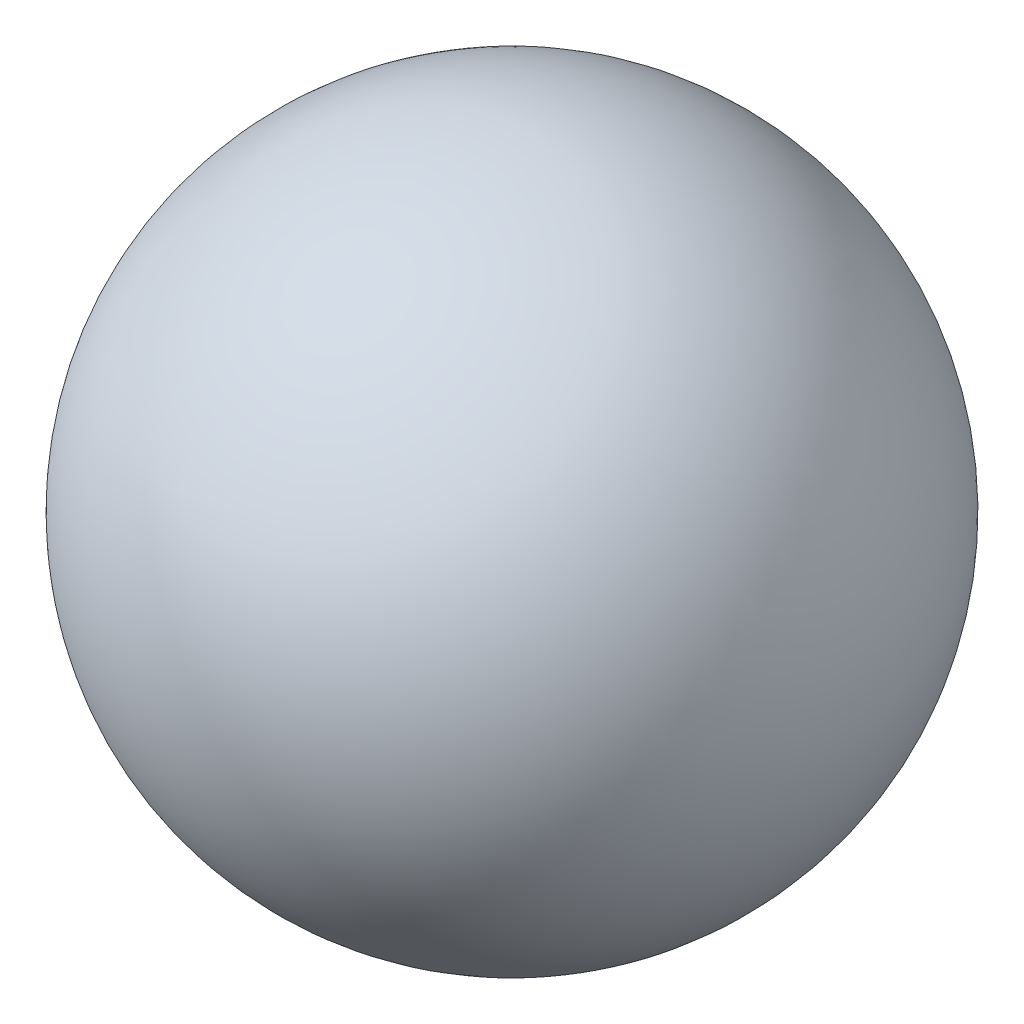
ISO-10303-21;
HEADER;
FILE_DESCRIPTION(('STEP AP214'),'2;1');
FILE_NAME('part.step','',(''),(''),'','','');
FILE_SCHEMA(('AUTOMOTIVE_DESIGN { 1 0 10303 214 1 1 1 1 }'));
ENDSEC;
DATA;
#1=APPLICATION_CONTEXT('core data for automotive mechanical design processes');
#2=APPLICATION_PROTOCOL_DEFINITION('international standard','automotive_design',2000,#1);
#3=PRODUCT_CONTEXT('',#1,'mechanical');
#4=PRODUCT('Part','Part','',(#3));
#5=PRODUCT_RELATED_PRODUCT_CATEGORY('part','',(#4));
#6=PRODUCT_DEFINITION_FORMATION('','',#4);
#7=PRODUCT_DEFINITION_CONTEXT('part definition',#1,'design');
#8=PRODUCT_DEFINITION('design','',#6,#7);
#9=PRODUCT_DEFINITION_SHAPE('','',#8);
#10=(LENGTH_UNIT() NAMED_UNIT(*) SI_UNIT(.MILLI.,.METRE.));
#11=(NAMED_UNIT(*) PLANE_ANGLE_UNIT() SI_UNIT($,.RADIAN.));
#12=(NAMED_UNIT(*) SI_UNIT($,.STERADIAN.) SOLID_ANGLE_UNIT());
#13=UNCERTAINTY_MEASURE_WITH_UNIT(LENGTH_MEASURE(1.E-05),#10,'distance_accuracy_value','');
#14=(GEOMETRIC_REPRESENTATION_CONTEXT(3) GLOBAL_UNCERTAINTY_ASSIGNED_CONTEXT((#13)) GLOBAL_UNIT_ASSIGNED_CONTEXT((#10,
#11,#12)) REPRESENTATION_CONTEXT('',''));
#15=CARTESIAN_POINT('',(0.,0.,0.));
#16=DIRECTION('',(0.,0.,1.));
#17=DIRECTION('',(1.,0.,0.));
#18=AXIS2_PLACEMENT_3D('',#15,#16,#17);
#19=CARTESIAN_POINT('',(0.,0.,0.));
#20=DIRECTION('',(-0.174565650128981,0.984645537132549,0.));
#21=DIRECTION('',(-0.984645537132549,-0.174565650128981,0.));
#22=AXIS2_PLACEMENT_3D('',#19,#20,#21);
#23=SPHERICAL_SURFACE('',#22,88.9);
#24=CARTESIAN_POINT('',(-15.5188862964664,87.5349882510836,0.));
#25=VERTEX_POINT('',#24);
#26=VERTEX_LOOP('',#25);
#27=FACE_BOUND('',#26,.T.);
#28=ADVANCED_FACE('F35',(#27),#23,.T.);
#29=CLOSED_SHELL('',(#28));
#30=MANIFOLD_SOLID_BREP('B2',#29);
#31=ADVANCED_BREP_SHAPE_REPRESENTATION('',(#18,#30),#14);
#32=SHAPE_DEFINITION_REPRESENTATION(#9,#31);
ENDSEC;
END-ISO-10303-21;
